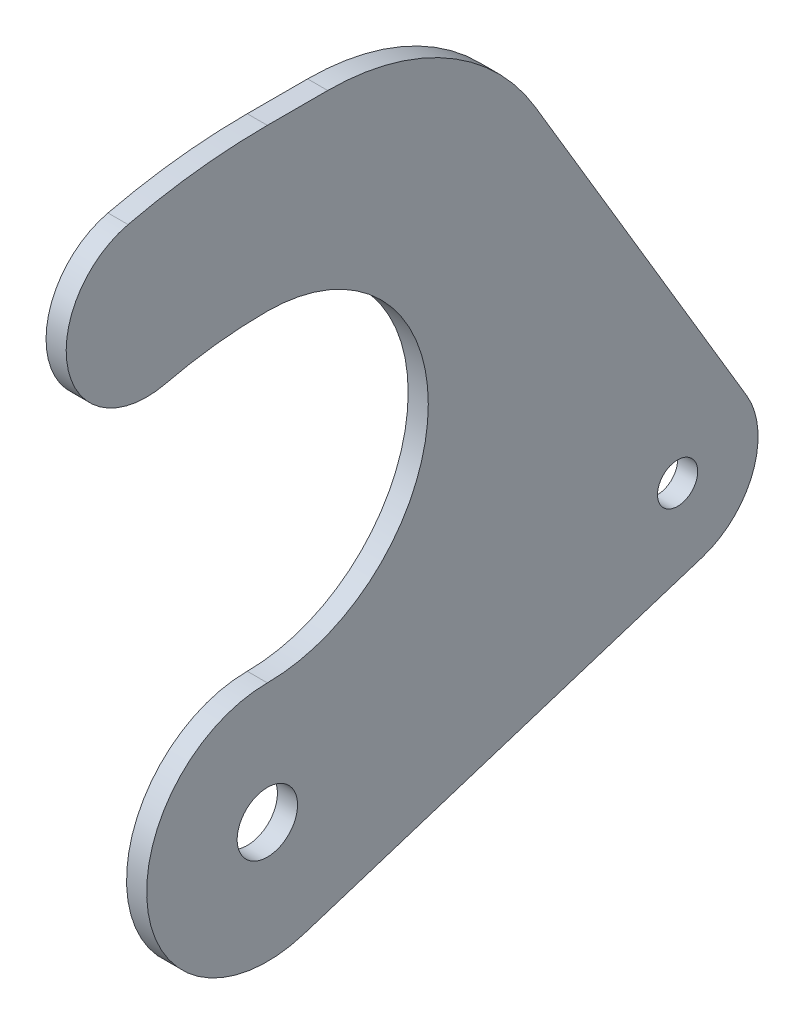
ISO-10303-21;
HEADER;
FILE_DESCRIPTION(('STEP AP214'),'2;1');
FILE_NAME('part.step','',(''),(''),'','','');
FILE_SCHEMA(('AUTOMOTIVE_DESIGN { 1 0 10303 214 1 1 1 1 }'));
ENDSEC;
DATA;
#1=APPLICATION_CONTEXT('core data for automotive mechanical design processes');
#2=APPLICATION_PROTOCOL_DEFINITION('international standard','automotive_design',2000,#1);
#3=PRODUCT_CONTEXT('',#1,'mechanical');
#4=PRODUCT('Part','Part','',(#3));
#5=PRODUCT_RELATED_PRODUCT_CATEGORY('part','',(#4));
#6=PRODUCT_DEFINITION_FORMATION('','',#4);
#7=PRODUCT_DEFINITION_CONTEXT('part definition',#1,'design');
#8=PRODUCT_DEFINITION('design','',#6,#7);
#9=PRODUCT_DEFINITION_SHAPE('','',#8);
#10=(LENGTH_UNIT() NAMED_UNIT(*) SI_UNIT(.MILLI.,.METRE.));
#11=(NAMED_UNIT(*) PLANE_ANGLE_UNIT() SI_UNIT($,.RADIAN.));
#12=(NAMED_UNIT(*) SI_UNIT($,.STERADIAN.) SOLID_ANGLE_UNIT());
#13=UNCERTAINTY_MEASURE_WITH_UNIT(LENGTH_MEASURE(1.E-05),#10,'distance_accuracy_value','');
#14=(GEOMETRIC_REPRESENTATION_CONTEXT(3) GLOBAL_UNCERTAINTY_ASSIGNED_CONTEXT((#13)) GLOBAL_UNIT_ASSIGNED_CONTEXT((#10,
#11,#12)) REPRESENTATION_CONTEXT('',''));
#15=CARTESIAN_POINT('',(0.,0.,0.));
#16=DIRECTION('',(0.,0.,1.));
#17=DIRECTION('',(1.,0.,0.));
#18=AXIS2_PLACEMENT_3D('',#15,#16,#17);
#19=CARTESIAN_POINT('',(3.175,0.,0.));
#20=DIRECTION('',(1.,0.,0.));
#21=DIRECTION('',(0.,0.,-1.));
#22=AXIS2_PLACEMENT_3D('',#19,#20,#21);
#23=PLANE('',#22);
#24=CARTESIAN_POINT('',(3.175,0.,0.));
#25=DIRECTION('',(1.,0.,0.));
#26=DIRECTION('',(0.,0.,-1.));
#27=AXIS2_PLACEMENT_3D('',#24,#25,#26);
#28=CIRCLE('',#27,4.7625);
#29=CARTESIAN_POINT('',(3.175,0.,-4.7625));
#30=VERTEX_POINT('',#29);
#31=EDGE_CURVE('E185',#30,#30,#28,.T.);
#32=ORIENTED_EDGE('',*,*,#31,.F.);
#33=EDGE_LOOP('',(#32));
#34=FACE_BOUND('',#33,.T.);
#35=CARTESIAN_POINT('',(3.175,0.,0.));
#36=DIRECTION('',(-1.,0.,0.));
#37=DIRECTION('',(0.,0.,-1.));
#38=AXIS2_PLACEMENT_3D('',#35,#36,#37);
#39=CIRCLE('',#38,69.85);
#40=CARTESIAN_POINT('',(3.175,67.9646444808496,16.1192307692308));
#41=VERTEX_POINT('',#40);
#42=CARTESIAN_POINT('',(3.175,69.85,-2.69161480889681E-13));
#43=VERTEX_POINT('',#42);
#44=EDGE_CURVE('E208',#41,#43,#39,.T.);
#45=ORIENTED_EDGE('',*,*,#44,.T.);
#46=CARTESIAN_POINT('',(3.175,44.45,0.));
#47=DIRECTION('',(-1.,0.,0.));
#48=DIRECTION('',(0.,0.,1.));
#49=AXIS2_PLACEMENT_3D('',#46,#47,#48);
#50=CIRCLE('',#49,25.4);
#51=CARTESIAN_POINT('',(3.175,19.05,0.));
#52=VERTEX_POINT('',#51);
#53=EDGE_CURVE('E129',#43,#52,#50,.T.);
#54=ORIENTED_EDGE('',*,*,#53,.T.);
#55=CARTESIAN_POINT('',(3.175,0.,0.));
#56=DIRECTION('',(1.,0.,0.));
#57=DIRECTION('',(0.,0.,1.));
#58=AXIS2_PLACEMENT_3D('',#55,#56,#57);
#59=CIRCLE('',#58,19.05);
#60=CARTESIAN_POINT('',(3.175,-18.1493718963639,-5.78816030941408));
#61=VERTEX_POINT('',#60);
#62=EDGE_CURVE('E237',#52,#61,#59,.T.);
#63=ORIENTED_EDGE('',*,*,#62,.T.);
#64=DIRECTION('',(0.,0.303840436189715,-0.95272293419233));
#65=VECTOR('',#64,1.);
#66=CARTESIAN_POINT('',(3.175,-18.1493718963639,-5.78816030941407));
#67=LINE('',#66,#65);
#68=CARTESIAN_POINT('',(3.175,1.88243578112449,-68.5999533248666));
#69=VERTEX_POINT('',#68);
#70=EDGE_CURVE('E257',#61,#69,#67,.T.);
#71=ORIENTED_EDGE('',*,*,#70,.T.);
#72=CARTESIAN_POINT('',(3.175,13.9820170453671,-64.7411797852572));
#73=DIRECTION('',(1.,0.,0.));
#74=DIRECTION('',(0.,0.,-1.));
#75=AXIS2_PLACEMENT_3D('',#72,#73,#74);
#76=CIRCLE('',#75,12.7);
#77=CARTESIAN_POINT('',(3.175,20.4723727818406,-75.6574649782167));
#78=VERTEX_POINT('',#77);
#79=EDGE_CURVE('E253',#69,#78,#76,.T.);
#80=ORIENTED_EDGE('',*,*,#79,.T.);
#81=DIRECTION('',(0.,0.859550015193658,0.511051632793187));
#82=VECTOR('',#81,1.);
#83=CARTESIAN_POINT('',(3.175,76.6210672094204,-42.2738555788784));
#84=LINE('',#83,#82);
#85=CARTESIAN_POINT('',(3.175,76.6210672094204,-42.2738555788784));
#86=VERTEX_POINT('',#85);
#87=EDGE_CURVE('E256',#78,#86,#84,.T.);
#88=ORIENTED_EDGE('',*,*,#87,.T.);
#89=CARTESIAN_POINT('',(3.175,57.15,-9.52499999999999));
#90=DIRECTION('',(1.,0.,0.));
#91=DIRECTION('',(0.,0.,1.));
#92=AXIS2_PLACEMENT_3D('',#89,#90,#91);
#93=CIRCLE('',#92,38.1);
#94=CARTESIAN_POINT('',(3.175,95.25,-9.52499999999999));
#95=VERTEX_POINT('',#94);
#96=EDGE_CURVE('E157',#86,#95,#93,.T.);
#97=ORIENTED_EDGE('',*,*,#96,.T.);
#98=DIRECTION('',(0.,0.,1.));
#99=VECTOR('',#98,1.);
#100=CARTESIAN_POINT('',(3.175,95.25,0.));
#101=LINE('',#100,#99);
#102=CARTESIAN_POINT('',(3.175,95.25,0.));
#103=VERTEX_POINT('',#102);
#104=EDGE_CURVE('E151',#95,#103,#101,.T.);
#105=ORIENTED_EDGE('',*,*,#104,.T.);
#106=CARTESIAN_POINT('',(3.175,0.,0.));
#107=DIRECTION('',(1.,0.,0.));
#108=DIRECTION('',(0.,0.,-1.));
#109=AXIS2_PLACEMENT_3D('',#106,#107,#108);
#110=CIRCLE('',#109,95.25);
#111=CARTESIAN_POINT('',(3.175,92.6790606557041,21.9807692307692));
#112=VERTEX_POINT('',#111);
#113=EDGE_CURVE('E155',#103,#112,#110,.T.);
#114=ORIENTED_EDGE('',*,*,#113,.T.);
#115=CARTESIAN_POINT('',(3.175,80.3218525682768,19.05));
#116=DIRECTION('',(1.,0.,0.));
#117=DIRECTION('',(0.,0.,-1.));
#118=AXIS2_PLACEMENT_3D('',#115,#116,#117);
#119=CIRCLE('',#118,12.7);
#120=EDGE_CURVE('E68',#112,#41,#119,.T.);
#121=ORIENTED_EDGE('',*,*,#120,.T.);
#122=EDGE_LOOP('',(#45,#54,#63,#71,#80,#88,#97,#105,#114,#121));
#123=FACE_BOUND('',#122,.T.);
#124=CARTESIAN_POINT('',(3.175,13.9820170453671,-64.7411797852572));
#125=DIRECTION('',(1.,0.,0.));
#126=DIRECTION('',(0.,0.,-1.));
#127=AXIS2_PLACEMENT_3D('',#124,#125,#126);
#128=CIRCLE('',#127,3.17500000000056);
#129=CARTESIAN_POINT('',(3.175,13.9820170453671,-67.9161797852578));
#130=VERTEX_POINT('',#129);
#131=EDGE_CURVE('E268',#130,#130,#128,.T.);
#132=ORIENTED_EDGE('',*,*,#131,.F.);
#133=EDGE_LOOP('',(#132));
#134=FACE_BOUND('',#133,.T.);
#135=ADVANCED_FACE('F47',(#34,#123,#134),#23,.T.);
#136=CARTESIAN_POINT('',(0.,0.,0.));
#137=DIRECTION('',(1.,0.,0.));
#138=DIRECTION('',(0.,0.,-1.));
#139=AXIS2_PLACEMENT_3D('',#136,#137,#138);
#140=PLANE('',#139);
#141=CARTESIAN_POINT('',(0.,0.,0.));
#142=DIRECTION('',(-1.,0.,0.));
#143=DIRECTION('',(0.,0.,-1.));
#144=AXIS2_PLACEMENT_3D('',#141,#142,#143);
#145=CIRCLE('',#144,69.85);
#146=CARTESIAN_POINT('',(0.,67.9646444808496,16.1192307692308));
#147=VERTEX_POINT('',#146);
#148=CARTESIAN_POINT('',(0.,69.85,-2.69161480889681E-13));
#149=VERTEX_POINT('',#148);
#150=EDGE_CURVE('E180',#147,#149,#145,.T.);
#151=ORIENTED_EDGE('',*,*,#150,.F.);
#152=CARTESIAN_POINT('',(0.,80.3218525682768,19.05));
#153=DIRECTION('',(1.,0.,0.));
#154=DIRECTION('',(0.,0.,-1.));
#155=AXIS2_PLACEMENT_3D('',#152,#153,#154);
#156=CIRCLE('',#155,12.7);
#157=CARTESIAN_POINT('',(0.,92.6790606557041,21.9807692307692));
#158=VERTEX_POINT('',#157);
#159=EDGE_CURVE('E119',#158,#147,#156,.T.);
#160=ORIENTED_EDGE('',*,*,#159,.F.);
#161=CARTESIAN_POINT('',(0.,0.,0.));
#162=DIRECTION('',(1.,0.,0.));
#163=DIRECTION('',(0.,0.,-1.));
#164=AXIS2_PLACEMENT_3D('',#161,#162,#163);
#165=CIRCLE('',#164,95.25);
#166=CARTESIAN_POINT('',(0.,95.25,0.));
#167=VERTEX_POINT('',#166);
#168=EDGE_CURVE('E112',#167,#158,#165,.T.);
#169=ORIENTED_EDGE('',*,*,#168,.F.);
#170=DIRECTION('',(0.,0.,1.));
#171=VECTOR('',#170,1.);
#172=CARTESIAN_POINT('',(0.,95.25,0.));
#173=LINE('',#172,#171);
#174=CARTESIAN_POINT('',(0.,95.25,-9.52499999999999));
#175=VERTEX_POINT('',#174);
#176=EDGE_CURVE('E166',#175,#167,#173,.T.);
#177=ORIENTED_EDGE('',*,*,#176,.F.);
#178=CARTESIAN_POINT('',(0.,57.15,-9.52499999999999));
#179=DIRECTION('',(1.,0.,0.));
#180=DIRECTION('',(0.,0.,1.));
#181=AXIS2_PLACEMENT_3D('',#178,#179,#180);
#182=CIRCLE('',#181,38.1);
#183=CARTESIAN_POINT('',(0.,76.6210672094204,-42.2738555788784));
#184=VERTEX_POINT('',#183);
#185=EDGE_CURVE('E200',#184,#175,#182,.T.);
#186=ORIENTED_EDGE('',*,*,#185,.F.);
#187=DIRECTION('',(0.,0.859550015193658,0.511051632793187));
#188=VECTOR('',#187,1.);
#189=CARTESIAN_POINT('',(0.,76.6210672094204,-42.2738555788784));
#190=LINE('',#189,#188);
#191=CARTESIAN_POINT('',(0.,20.4723727818406,-75.6574649782167));
#192=VERTEX_POINT('',#191);
#193=EDGE_CURVE('E197',#192,#184,#190,.T.);
#194=ORIENTED_EDGE('',*,*,#193,.F.);
#195=CARTESIAN_POINT('',(0.,13.9820170453671,-64.7411797852572));
#196=DIRECTION('',(1.,0.,0.));
#197=DIRECTION('',(0.,0.,-1.));
#198=AXIS2_PLACEMENT_3D('',#195,#196,#197);
#199=CIRCLE('',#198,12.7);
#200=CARTESIAN_POINT('',(0.,1.88243578112449,-68.5999533248666));
#201=VERTEX_POINT('',#200);
#202=EDGE_CURVE('E194',#201,#192,#199,.T.);
#203=ORIENTED_EDGE('',*,*,#202,.F.);
#204=DIRECTION('',(0.,0.303840436189715,-0.95272293419233));
#205=VECTOR('',#204,1.);
#206=CARTESIAN_POINT('',(0.,-18.1493718963639,-5.78816030941407));
#207=LINE('',#206,#205);
#208=CARTESIAN_POINT('',(0.,-18.1493718963639,-5.78816030941408));
#209=VERTEX_POINT('',#208);
#210=EDGE_CURVE('E191',#209,#201,#207,.T.);
#211=ORIENTED_EDGE('',*,*,#210,.F.);
#212=CARTESIAN_POINT('',(0.,0.,0.));
#213=DIRECTION('',(1.,0.,0.));
#214=DIRECTION('',(0.,0.,1.));
#215=AXIS2_PLACEMENT_3D('',#212,#213,#214);
#216=CIRCLE('',#215,19.05);
#217=CARTESIAN_POINT('',(0.,19.05,0.));
#218=VERTEX_POINT('',#217);
#219=EDGE_CURVE('E188',#218,#209,#216,.T.);
#220=ORIENTED_EDGE('',*,*,#219,.F.);
#221=CARTESIAN_POINT('',(0.,44.45,0.));
#222=DIRECTION('',(-1.,0.,0.));
#223=DIRECTION('',(0.,0.,1.));
#224=AXIS2_PLACEMENT_3D('',#221,#222,#223);
#225=CIRCLE('',#224,25.4);
#226=EDGE_CURVE('E184',#149,#218,#225,.T.);
#227=ORIENTED_EDGE('',*,*,#226,.F.);
#228=EDGE_LOOP('',(#151,#160,#169,#177,#186,#194,#203,#211,#220,#227));
#229=FACE_BOUND('',#228,.T.);
#230=CARTESIAN_POINT('',(0.,0.,0.));
#231=DIRECTION('',(1.,0.,0.));
#232=DIRECTION('',(0.,0.,-1.));
#233=AXIS2_PLACEMENT_3D('',#230,#231,#232);
#234=CIRCLE('',#233,4.7625);
#235=CARTESIAN_POINT('',(0.,0.,-4.7625));
#236=VERTEX_POINT('',#235);
#237=EDGE_CURVE('E271',#236,#236,#234,.T.);
#238=ORIENTED_EDGE('',*,*,#237,.T.);
#239=EDGE_LOOP('',(#238));
#240=FACE_BOUND('',#239,.T.);
#241=CARTESIAN_POINT('',(0.,13.9820170453671,-64.7411797852572));
#242=DIRECTION('',(1.,0.,0.));
#243=DIRECTION('',(0.,0.,-1.));
#244=AXIS2_PLACEMENT_3D('',#241,#242,#243);
#245=CIRCLE('',#244,3.17500000000056);
#246=CARTESIAN_POINT('',(0.,13.9820170453671,-67.9161797852578));
#247=VERTEX_POINT('',#246);
#248=EDGE_CURVE('E272',#247,#247,#245,.T.);
#249=ORIENTED_EDGE('',*,*,#248,.T.);
#250=EDGE_LOOP('',(#249));
#251=FACE_BOUND('',#250,.T.);
#252=ADVANCED_FACE('F241',(#229,#240,#251),#140,.F.);
#253=CARTESIAN_POINT('',(3.175,0.,0.));
#254=DIRECTION('',(-1.,0.,0.));
#255=DIRECTION('',(0.,0.,1.));
#256=AXIS2_PLACEMENT_3D('',#253,#254,#255);
#257=CYLINDRICAL_SURFACE('',#256,69.85);
#258=ORIENTED_EDGE('',*,*,#150,.T.);
#259=DIRECTION('',(-1.,0.,0.));
#260=VECTOR('',#259,1.);
#261=CARTESIAN_POINT('',(3.175,69.85,-2.69161480889681E-13));
#262=LINE('',#261,#260);
#263=EDGE_CURVE('E13',#43,#149,#262,.T.);
#264=ORIENTED_EDGE('',*,*,#263,.F.);
#265=ORIENTED_EDGE('',*,*,#44,.F.);
#266=DIRECTION('',(-1.,0.,0.));
#267=VECTOR('',#266,1.);
#268=CARTESIAN_POINT('',(3.175,67.9646444808496,16.1192307692308));
#269=LINE('',#268,#267);
#270=EDGE_CURVE('E176',#41,#147,#269,.T.);
#271=ORIENTED_EDGE('',*,*,#270,.T.);
#272=EDGE_LOOP('',(#258,#264,#265,#271));
#273=FACE_BOUND('',#272,.T.);
#274=ADVANCED_FACE('F49',(#273),#257,.F.);
#275=CARTESIAN_POINT('',(3.175,44.45,0.));
#276=DIRECTION('',(-1.,0.,0.));
#277=DIRECTION('',(0.,0.,1.));
#278=AXIS2_PLACEMENT_3D('',#275,#276,#277);
#279=CYLINDRICAL_SURFACE('',#278,25.4);
#280=ORIENTED_EDGE('',*,*,#226,.T.);
#281=DIRECTION('',(-1.,0.,0.));
#282=VECTOR('',#281,1.);
#283=CARTESIAN_POINT('',(3.175,19.05,0.));
#284=LINE('',#283,#282);
#285=EDGE_CURVE('E57',#52,#218,#284,.T.);
#286=ORIENTED_EDGE('',*,*,#285,.F.);
#287=ORIENTED_EDGE('',*,*,#53,.F.);
#288=ORIENTED_EDGE('',*,*,#263,.T.);
#289=EDGE_LOOP('',(#280,#286,#287,#288));
#290=FACE_BOUND('',#289,.T.);
#291=ADVANCED_FACE('F326',(#290),#279,.F.);
#292=CARTESIAN_POINT('',(3.175,0.,0.));
#293=DIRECTION('',(-1.,0.,0.));
#294=DIRECTION('',(0.,0.,1.));
#295=AXIS2_PLACEMENT_3D('',#292,#293,#294);
#296=CYLINDRICAL_SURFACE('',#295,19.05);
#297=ORIENTED_EDGE('',*,*,#219,.T.);
#298=DIRECTION('',(-1.,0.,0.));
#299=VECTOR('',#298,1.);
#300=CARTESIAN_POINT('',(3.175,-18.1493718963639,-5.78816030941408));
#301=LINE('',#300,#299);
#302=EDGE_CURVE('E226',#61,#209,#301,.T.);
#303=ORIENTED_EDGE('',*,*,#302,.F.);
#304=ORIENTED_EDGE('',*,*,#62,.F.);
#305=ORIENTED_EDGE('',*,*,#285,.T.);
#306=EDGE_LOOP('',(#297,#303,#304,#305));
#307=FACE_BOUND('',#306,.T.);
#308=ADVANCED_FACE('F235',(#307),#296,.T.);
#309=CARTESIAN_POINT('',(3.175,-18.1493718963639,-5.78816030941407));
#310=DIRECTION('',(0.,0.95272293419233,0.303840436189715));
#311=DIRECTION('',(0.,-0.303840436189715,0.952722934192331));
#312=AXIS2_PLACEMENT_3D('',#309,#310,#311);
#313=PLANE('',#312);
#314=ORIENTED_EDGE('',*,*,#210,.T.);
#315=DIRECTION('',(-1.,0.,0.));
#316=VECTOR('',#315,1.);
#317=CARTESIAN_POINT('',(3.175,1.88243578112449,-68.5999533248666));
#318=LINE('',#317,#316);
#319=EDGE_CURVE('E222',#69,#201,#318,.T.);
#320=ORIENTED_EDGE('',*,*,#319,.F.);
#321=ORIENTED_EDGE('',*,*,#70,.F.);
#322=ORIENTED_EDGE('',*,*,#302,.T.);
#323=EDGE_LOOP('',(#314,#320,#321,#322));
#324=FACE_BOUND('',#323,.T.);
#325=ADVANCED_FACE('F247',(#324),#313,.F.);
#326=CARTESIAN_POINT('',(3.175,13.9820170453671,-64.7411797852572));
#327=DIRECTION('',(-1.,0.,0.));
#328=DIRECTION('',(0.,0.,1.));
#329=AXIS2_PLACEMENT_3D('',#326,#327,#328);
#330=CYLINDRICAL_SURFACE('',#329,12.7);
#331=ORIENTED_EDGE('',*,*,#202,.T.);
#332=DIRECTION('',(-1.,0.,0.));
#333=VECTOR('',#332,1.);
#334=CARTESIAN_POINT('',(3.175,20.4723727818406,-75.6574649782167));
#335=LINE('',#334,#333);
#336=EDGE_CURVE('E218',#78,#192,#335,.T.);
#337=ORIENTED_EDGE('',*,*,#336,.F.);
#338=ORIENTED_EDGE('',*,*,#79,.F.);
#339=ORIENTED_EDGE('',*,*,#319,.T.);
#340=EDGE_LOOP('',(#331,#337,#338,#339));
#341=FACE_BOUND('',#340,.T.);
#342=ADVANCED_FACE('F251',(#341),#330,.T.);
#343=CARTESIAN_POINT('',(3.175,76.6210672094204,-42.2738555788784));
#344=DIRECTION('',(0.,-0.511051632793187,0.859550015193658));
#345=DIRECTION('',(0.,-0.859550015193658,-0.511051632793187));
#346=AXIS2_PLACEMENT_3D('',#343,#344,#345);
#347=PLANE('',#346);
#348=ORIENTED_EDGE('',*,*,#193,.T.);
#349=DIRECTION('',(-1.,0.,0.));
#350=VECTOR('',#349,1.);
#351=CARTESIAN_POINT('',(3.175,76.6210672094204,-42.2738555788784));
#352=LINE('',#351,#350);
#353=EDGE_CURVE('E214',#86,#184,#352,.T.);
#354=ORIENTED_EDGE('',*,*,#353,.F.);
#355=ORIENTED_EDGE('',*,*,#87,.F.);
#356=ORIENTED_EDGE('',*,*,#336,.T.);
#357=EDGE_LOOP('',(#348,#354,#355,#356));
#358=FACE_BOUND('',#357,.T.);
#359=ADVANCED_FACE('F316',(#358),#347,.F.);
#360=CARTESIAN_POINT('',(3.175,57.15,-9.52499999999999));
#361=DIRECTION('',(-1.,0.,0.));
#362=DIRECTION('',(0.,0.,1.));
#363=AXIS2_PLACEMENT_3D('',#360,#361,#362);
#364=CYLINDRICAL_SURFACE('',#363,38.1);
#365=ORIENTED_EDGE('',*,*,#185,.T.);
#366=DIRECTION('',(-1.,0.,0.));
#367=VECTOR('',#366,1.);
#368=CARTESIAN_POINT('',(3.175,95.25,-9.52499999999999));
#369=LINE('',#368,#367);
#370=EDGE_CURVE('E168',#95,#175,#369,.T.);
#371=ORIENTED_EDGE('',*,*,#370,.F.);
#372=ORIENTED_EDGE('',*,*,#96,.F.);
#373=ORIENTED_EDGE('',*,*,#353,.T.);
#374=EDGE_LOOP('',(#365,#371,#372,#373));
#375=FACE_BOUND('',#374,.T.);
#376=ADVANCED_FACE('F313',(#375),#364,.T.);
#377=CARTESIAN_POINT('',(3.175,95.25,0.));
#378=DIRECTION('',(0.,-1.,0.));
#379=DIRECTION('',(0.,0.,-1.));
#380=AXIS2_PLACEMENT_3D('',#377,#378,#379);
#381=PLANE('',#380);
#382=ORIENTED_EDGE('',*,*,#176,.T.);
#383=DIRECTION('',(-1.,0.,0.));
#384=VECTOR('',#383,1.);
#385=CARTESIAN_POINT('',(3.175,95.25,0.));
#386=LINE('',#385,#384);
#387=EDGE_CURVE('E163',#103,#167,#386,.T.);
#388=ORIENTED_EDGE('',*,*,#387,.F.);
#389=ORIENTED_EDGE('',*,*,#104,.F.);
#390=ORIENTED_EDGE('',*,*,#370,.T.);
#391=EDGE_LOOP('',(#382,#388,#389,#390));
#392=FACE_BOUND('',#391,.T.);
#393=ADVANCED_FACE('F164',(#392),#381,.F.);
#394=CARTESIAN_POINT('',(3.175,0.,0.));
#395=DIRECTION('',(-1.,0.,0.));
#396=DIRECTION('',(0.,0.,1.));
#397=AXIS2_PLACEMENT_3D('',#394,#395,#396);
#398=CYLINDRICAL_SURFACE('',#397,95.25);
#399=ORIENTED_EDGE('',*,*,#168,.T.);
#400=DIRECTION('',(-1.,0.,0.));
#401=VECTOR('',#400,1.);
#402=CARTESIAN_POINT('',(3.175,92.6790606557041,21.9807692307692));
#403=LINE('',#402,#401);
#404=EDGE_CURVE('E169',#112,#158,#403,.T.);
#405=ORIENTED_EDGE('',*,*,#404,.F.);
#406=ORIENTED_EDGE('',*,*,#113,.F.);
#407=ORIENTED_EDGE('',*,*,#387,.T.);
#408=EDGE_LOOP('',(#399,#405,#406,#407));
#409=FACE_BOUND('',#408,.T.);
#410=ADVANCED_FACE('F171',(#409),#398,.T.);
#411=CARTESIAN_POINT('',(3.175,80.3218525682768,19.05));
#412=DIRECTION('',(-1.,0.,0.));
#413=DIRECTION('',(0.,0.,1.));
#414=AXIS2_PLACEMENT_3D('',#411,#412,#413);
#415=CYLINDRICAL_SURFACE('',#414,12.7);
#416=ORIENTED_EDGE('',*,*,#159,.T.);
#417=ORIENTED_EDGE('',*,*,#270,.F.);
#418=ORIENTED_EDGE('',*,*,#120,.F.);
#419=ORIENTED_EDGE('',*,*,#404,.T.);
#420=EDGE_LOOP('',(#416,#417,#418,#419));
#421=FACE_BOUND('',#420,.T.);
#422=ADVANCED_FACE('F295',(#421),#415,.T.);
#423=CARTESIAN_POINT('',(3.175,0.,0.));
#424=DIRECTION('',(-1.,0.,0.));
#425=DIRECTION('',(0.,0.,1.));
#426=AXIS2_PLACEMENT_3D('',#423,#424,#425);
#427=CYLINDRICAL_SURFACE('',#426,4.7625);
#428=ORIENTED_EDGE('',*,*,#31,.T.);
#429=EDGE_LOOP('',(#428));
#430=FACE_BOUND('',#429,.T.);
#431=ORIENTED_EDGE('',*,*,#237,.F.);
#432=EDGE_LOOP('',(#431));
#433=FACE_BOUND('',#432,.T.);
#434=ADVANCED_FACE('F289',(#430,#433),#427,.F.);
#435=CARTESIAN_POINT('',(3.175,13.9820170453671,-64.7411797852572));
#436=DIRECTION('',(-1.,0.,0.));
#437=DIRECTION('',(0.,0.,1.));
#438=AXIS2_PLACEMENT_3D('',#435,#436,#437);
#439=CYLINDRICAL_SURFACE('',#438,3.17500000000056);
#440=ORIENTED_EDGE('',*,*,#131,.T.);
#441=EDGE_LOOP('',(#440));
#442=FACE_BOUND('',#441,.T.);
#443=ORIENTED_EDGE('',*,*,#248,.F.);
#444=EDGE_LOOP('',(#443));
#445=FACE_BOUND('',#444,.T.);
#446=ADVANCED_FACE('F287',(#442,#445),#439,.F.);
#447=CLOSED_SHELL('',(#135,#252,#274,#291,#308,#325,#342,#359,#376,#393,#410,#422,#434,#446));
#448=MANIFOLD_SOLID_BREP('B2',#447);
#449=ADVANCED_BREP_SHAPE_REPRESENTATION('',(#18,#448),#14);
#450=SHAPE_DEFINITION_REPRESENTATION(#9,#449);
ENDSEC;
END-ISO-10303-21;
